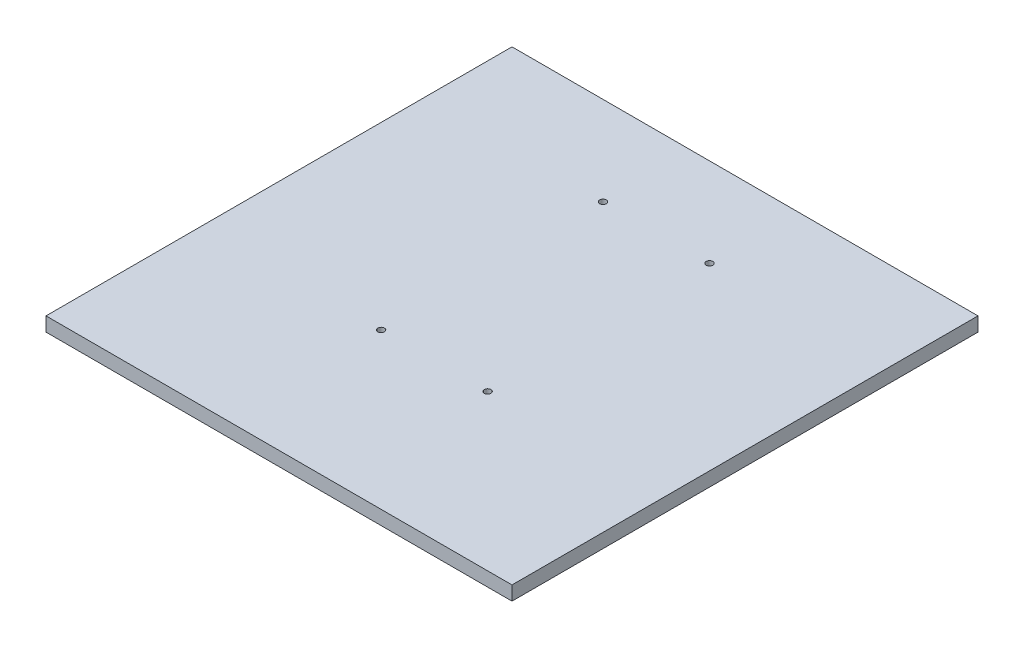
ISO-10303-21;
HEADER;
FILE_DESCRIPTION(('STEP AP214'),'2;1');
FILE_NAME('part.step','',(''),(''),'','','');
FILE_SCHEMA(('AUTOMOTIVE_DESIGN { 1 0 10303 214 1 1 1 1 }'));
ENDSEC;
DATA;
#1=APPLICATION_CONTEXT('core data for automotive mechanical design processes');
#2=APPLICATION_PROTOCOL_DEFINITION('international standard','automotive_design',2000,#1);
#3=PRODUCT_CONTEXT('',#1,'mechanical');
#4=PRODUCT('Part','Part','',(#3));
#5=PRODUCT_RELATED_PRODUCT_CATEGORY('part','',(#4));
#6=PRODUCT_DEFINITION_FORMATION('','',#4);
#7=PRODUCT_DEFINITION_CONTEXT('part definition',#1,'design');
#8=PRODUCT_DEFINITION('design','',#6,#7);
#9=PRODUCT_DEFINITION_SHAPE('','',#8);
#10=(LENGTH_UNIT() NAMED_UNIT(*) SI_UNIT(.MILLI.,.METRE.));
#11=(NAMED_UNIT(*) PLANE_ANGLE_UNIT() SI_UNIT($,.RADIAN.));
#12=(NAMED_UNIT(*) SI_UNIT($,.STERADIAN.) SOLID_ANGLE_UNIT());
#13=UNCERTAINTY_MEASURE_WITH_UNIT(LENGTH_MEASURE(1.E-05),#10,'distance_accuracy_value','');
#14=(GEOMETRIC_REPRESENTATION_CONTEXT(3) GLOBAL_UNCERTAINTY_ASSIGNED_CONTEXT((#13)) GLOBAL_UNIT_ASSIGNED_CONTEXT((#10,
#11,#12)) REPRESENTATION_CONTEXT('',''));
#15=CARTESIAN_POINT('',(0.,0.,0.));
#16=DIRECTION('',(0.,0.,1.));
#17=DIRECTION('',(1.,0.,0.));
#18=AXIS2_PLACEMENT_3D('',#15,#16,#17);
#19=CARTESIAN_POINT('',(-105.,6.35,105.));
#20=DIRECTION('',(1.,0.,0.));
#21=DIRECTION('',(0.,0.,-1.));
#22=AXIS2_PLACEMENT_3D('',#19,#20,#21);
#23=PLANE('',#22);
#24=DIRECTION('',(0.,0.,1.));
#25=VECTOR('',#24,1.);
#26=CARTESIAN_POINT('',(-105.,0.,105.));
#27=LINE('',#26,#25);
#28=CARTESIAN_POINT('',(-105.,0.,-105.));
#29=VERTEX_POINT('',#28);
#30=CARTESIAN_POINT('',(-105.,0.,105.));
#31=VERTEX_POINT('',#30);
#32=EDGE_CURVE('E96',#29,#31,#27,.T.);
#33=ORIENTED_EDGE('',*,*,#32,.T.);
#34=DIRECTION('',(0.,-1.,0.));
#35=VECTOR('',#34,1.);
#36=CARTESIAN_POINT('',(-105.,6.35,105.));
#37=LINE('',#36,#35);
#38=CARTESIAN_POINT('',(-105.,6.35,105.));
#39=VERTEX_POINT('',#38);
#40=EDGE_CURVE('E11',#39,#31,#37,.T.);
#41=ORIENTED_EDGE('',*,*,#40,.F.);
#42=DIRECTION('',(0.,0.,1.));
#43=VECTOR('',#42,1.);
#44=CARTESIAN_POINT('',(-105.,6.35,105.));
#45=LINE('',#44,#43);
#46=CARTESIAN_POINT('',(-105.,6.35,-105.));
#47=VERTEX_POINT('',#46);
#48=EDGE_CURVE('E84',#47,#39,#45,.T.);
#49=ORIENTED_EDGE('',*,*,#48,.F.);
#50=DIRECTION('',(0.,-1.,0.));
#51=VECTOR('',#50,1.);
#52=CARTESIAN_POINT('',(-105.,6.35,-105.));
#53=LINE('',#52,#51);
#54=EDGE_CURVE('E92',#47,#29,#53,.T.);
#55=ORIENTED_EDGE('',*,*,#54,.T.);
#56=EDGE_LOOP('',(#33,#41,#49,#55));
#57=FACE_BOUND('',#56,.T.);
#58=ADVANCED_FACE('F33',(#57),#23,.F.);
#59=CARTESIAN_POINT('',(105.,6.35,105.));
#60=DIRECTION('',(0.,0.,-1.));
#61=DIRECTION('',(-1.,0.,0.));
#62=AXIS2_PLACEMENT_3D('',#59,#60,#61);
#63=PLANE('',#62);
#64=DIRECTION('',(1.,0.,0.));
#65=VECTOR('',#64,1.);
#66=CARTESIAN_POINT('',(105.,0.,105.));
#67=LINE('',#66,#65);
#68=CARTESIAN_POINT('',(105.,0.,105.));
#69=VERTEX_POINT('',#68);
#70=EDGE_CURVE('E88',#31,#69,#67,.T.);
#71=ORIENTED_EDGE('',*,*,#70,.T.);
#72=DIRECTION('',(0.,-1.,0.));
#73=VECTOR('',#72,1.);
#74=CARTESIAN_POINT('',(105.,6.35,105.));
#75=LINE('',#74,#73);
#76=CARTESIAN_POINT('',(105.,6.35,105.));
#77=VERTEX_POINT('',#76);
#78=EDGE_CURVE('E41',#77,#69,#75,.T.);
#79=ORIENTED_EDGE('',*,*,#78,.F.);
#80=DIRECTION('',(1.,0.,0.));
#81=VECTOR('',#80,1.);
#82=CARTESIAN_POINT('',(105.,6.35,105.));
#83=LINE('',#82,#81);
#84=EDGE_CURVE('E79',#39,#77,#83,.T.);
#85=ORIENTED_EDGE('',*,*,#84,.F.);
#86=ORIENTED_EDGE('',*,*,#40,.T.);
#87=EDGE_LOOP('',(#71,#79,#85,#86));
#88=FACE_BOUND('',#87,.T.);
#89=ADVANCED_FACE('F87',(#88),#63,.F.);
#90=CARTESIAN_POINT('',(105.,6.35,105.));
#91=DIRECTION('',(-1.,0.,0.));
#92=DIRECTION('',(0.,0.,1.));
#93=AXIS2_PLACEMENT_3D('',#90,#91,#92);
#94=PLANE('',#93);
#95=DIRECTION('',(0.,0.,-1.));
#96=VECTOR('',#95,1.);
#97=CARTESIAN_POINT('',(105.,0.,105.));
#98=LINE('',#97,#96);
#99=CARTESIAN_POINT('',(105.,0.,-105.));
#100=VERTEX_POINT('',#99);
#101=EDGE_CURVE('E66',#69,#100,#98,.T.);
#102=ORIENTED_EDGE('',*,*,#101,.T.);
#103=DIRECTION('',(0.,-1.,0.));
#104=VECTOR('',#103,1.);
#105=CARTESIAN_POINT('',(105.,6.35,-105.));
#106=LINE('',#105,#104);
#107=CARTESIAN_POINT('',(105.,6.35,-105.));
#108=VERTEX_POINT('',#107);
#109=EDGE_CURVE('E89',#108,#100,#106,.T.);
#110=ORIENTED_EDGE('',*,*,#109,.F.);
#111=DIRECTION('',(0.,0.,-1.));
#112=VECTOR('',#111,1.);
#113=CARTESIAN_POINT('',(105.,6.35,105.));
#114=LINE('',#113,#112);
#115=EDGE_CURVE('E82',#77,#108,#114,.T.);
#116=ORIENTED_EDGE('',*,*,#115,.F.);
#117=ORIENTED_EDGE('',*,*,#78,.T.);
#118=EDGE_LOOP('',(#102,#110,#116,#117));
#119=FACE_BOUND('',#118,.T.);
#120=ADVANCED_FACE('F90',(#119),#94,.F.);
#121=CARTESIAN_POINT('',(105.,6.35,-105.));
#122=DIRECTION('',(0.,0.,1.));
#123=DIRECTION('',(1.,0.,0.));
#124=AXIS2_PLACEMENT_3D('',#121,#122,#123);
#125=PLANE('',#124);
#126=DIRECTION('',(-1.,0.,0.));
#127=VECTOR('',#126,1.);
#128=CARTESIAN_POINT('',(105.,0.,-105.));
#129=LINE('',#128,#127);
#130=EDGE_CURVE('E72',#100,#29,#129,.T.);
#131=ORIENTED_EDGE('',*,*,#130,.T.);
#132=ORIENTED_EDGE('',*,*,#54,.F.);
#133=DIRECTION('',(-1.,0.,0.));
#134=VECTOR('',#133,1.);
#135=CARTESIAN_POINT('',(105.,6.35,-105.));
#136=LINE('',#135,#134);
#137=EDGE_CURVE('E49',#108,#47,#136,.T.);
#138=ORIENTED_EDGE('',*,*,#137,.F.);
#139=ORIENTED_EDGE('',*,*,#109,.T.);
#140=EDGE_LOOP('',(#131,#132,#138,#139));
#141=FACE_BOUND('',#140,.T.);
#142=ADVANCED_FACE('F104',(#141),#125,.F.);
#143=CARTESIAN_POINT('',(0.,6.35,0.));
#144=DIRECTION('',(0.,1.,0.));
#145=DIRECTION('',(0.,0.,1.));
#146=AXIS2_PLACEMENT_3D('',#143,#144,#145);
#147=PLANE('',#146);
#148=CARTESIAN_POINT('',(24.,6.35,-65.));
#149=DIRECTION('',(0.,1.,0.));
#150=DIRECTION('',(0.,0.,1.));
#151=AXIS2_PLACEMENT_3D('',#148,#149,#150);
#152=CIRCLE('',#151,1.5);
#153=CARTESIAN_POINT('',(24.,6.35,-63.5));
#154=VERTEX_POINT('',#153);
#155=EDGE_CURVE('E128',#154,#154,#152,.T.);
#156=ORIENTED_EDGE('',*,*,#155,.F.);
#157=EDGE_LOOP('',(#156));
#158=FACE_BOUND('',#157,.T.);
#159=CARTESIAN_POINT('',(-24.,6.35,-65.));
#160=DIRECTION('',(0.,1.,0.));
#161=DIRECTION('',(0.,0.,1.));
#162=AXIS2_PLACEMENT_3D('',#159,#160,#161);
#163=CIRCLE('',#162,1.5);
#164=CARTESIAN_POINT('',(-24.,6.35,-63.5));
#165=VERTEX_POINT('',#164);
#166=EDGE_CURVE('E122',#165,#165,#163,.T.);
#167=ORIENTED_EDGE('',*,*,#166,.F.);
#168=EDGE_LOOP('',(#167));
#169=FACE_BOUND('',#168,.T.);
#170=CARTESIAN_POINT('',(-24.,6.35,35.));
#171=DIRECTION('',(0.,1.,0.));
#172=DIRECTION('',(0.,0.,1.));
#173=AXIS2_PLACEMENT_3D('',#170,#171,#172);
#174=CIRCLE('',#173,1.5);
#175=CARTESIAN_POINT('',(-24.,6.35,36.5));
#176=VERTEX_POINT('',#175);
#177=EDGE_CURVE('E116',#176,#176,#174,.T.);
#178=ORIENTED_EDGE('',*,*,#177,.F.);
#179=EDGE_LOOP('',(#178));
#180=FACE_BOUND('',#179,.T.);
#181=CARTESIAN_POINT('',(24.,6.35,35.));
#182=DIRECTION('',(0.,1.,0.));
#183=DIRECTION('',(0.,0.,1.));
#184=AXIS2_PLACEMENT_3D('',#181,#182,#183);
#185=CIRCLE('',#184,1.5);
#186=CARTESIAN_POINT('',(24.,6.35,36.5));
#187=VERTEX_POINT('',#186);
#188=EDGE_CURVE('E110',#187,#187,#185,.T.);
#189=ORIENTED_EDGE('',*,*,#188,.F.);
#190=EDGE_LOOP('',(#189));
#191=FACE_BOUND('',#190,.T.);
#192=ORIENTED_EDGE('',*,*,#48,.T.);
#193=ORIENTED_EDGE('',*,*,#84,.T.);
#194=ORIENTED_EDGE('',*,*,#115,.T.);
#195=ORIENTED_EDGE('',*,*,#137,.T.);
#196=EDGE_LOOP('',(#192,#193,#194,#195));
#197=FACE_BOUND('',#196,.T.);
#198=ADVANCED_FACE('F80',(#158,#169,#180,#191,#197),#147,.T.);
#199=CARTESIAN_POINT('',(0.,0.,0.));
#200=DIRECTION('',(0.,1.,0.));
#201=DIRECTION('',(0.,0.,1.));
#202=AXIS2_PLACEMENT_3D('',#199,#200,#201);
#203=PLANE('',#202);
#204=CARTESIAN_POINT('',(24.,0.,-65.));
#205=DIRECTION('',(0.,1.,0.));
#206=DIRECTION('',(0.,0.,1.));
#207=AXIS2_PLACEMENT_3D('',#204,#205,#206);
#208=CIRCLE('',#207,1.5);
#209=CARTESIAN_POINT('',(24.,0.,-63.5));
#210=VERTEX_POINT('',#209);
#211=EDGE_CURVE('E125',#210,#210,#208,.T.);
#212=ORIENTED_EDGE('',*,*,#211,.T.);
#213=EDGE_LOOP('',(#212));
#214=FACE_BOUND('',#213,.T.);
#215=CARTESIAN_POINT('',(-24.,0.,-65.));
#216=DIRECTION('',(0.,1.,0.));
#217=DIRECTION('',(0.,0.,1.));
#218=AXIS2_PLACEMENT_3D('',#215,#216,#217);
#219=CIRCLE('',#218,1.5);
#220=CARTESIAN_POINT('',(-24.,0.,-63.5));
#221=VERTEX_POINT('',#220);
#222=EDGE_CURVE('E119',#221,#221,#219,.T.);
#223=ORIENTED_EDGE('',*,*,#222,.T.);
#224=EDGE_LOOP('',(#223));
#225=FACE_BOUND('',#224,.T.);
#226=CARTESIAN_POINT('',(-24.,0.,35.));
#227=DIRECTION('',(0.,1.,0.));
#228=DIRECTION('',(0.,0.,1.));
#229=AXIS2_PLACEMENT_3D('',#226,#227,#228);
#230=CIRCLE('',#229,1.5);
#231=CARTESIAN_POINT('',(-24.,0.,36.5));
#232=VERTEX_POINT('',#231);
#233=EDGE_CURVE('E113',#232,#232,#230,.T.);
#234=ORIENTED_EDGE('',*,*,#233,.T.);
#235=EDGE_LOOP('',(#234));
#236=FACE_BOUND('',#235,.T.);
#237=CARTESIAN_POINT('',(24.,0.,35.));
#238=DIRECTION('',(0.,1.,0.));
#239=DIRECTION('',(0.,0.,1.));
#240=AXIS2_PLACEMENT_3D('',#237,#238,#239);
#241=CIRCLE('',#240,1.5);
#242=CARTESIAN_POINT('',(24.,0.,36.5));
#243=VERTEX_POINT('',#242);
#244=EDGE_CURVE('E99',#243,#243,#241,.T.);
#245=ORIENTED_EDGE('',*,*,#244,.T.);
#246=EDGE_LOOP('',(#245));
#247=FACE_BOUND('',#246,.T.);
#248=ORIENTED_EDGE('',*,*,#32,.F.);
#249=ORIENTED_EDGE('',*,*,#130,.F.);
#250=ORIENTED_EDGE('',*,*,#101,.F.);
#251=ORIENTED_EDGE('',*,*,#70,.F.);
#252=EDGE_LOOP('',(#248,#249,#250,#251));
#253=FACE_BOUND('',#252,.T.);
#254=ADVANCED_FACE('F107',(#214,#225,#236,#247,#253),#203,.F.);
#255=CARTESIAN_POINT('',(24.,0.,35.));
#256=DIRECTION('',(0.,1.,0.));
#257=DIRECTION('',(0.,0.,1.));
#258=AXIS2_PLACEMENT_3D('',#255,#256,#257);
#259=CYLINDRICAL_SURFACE('',#258,1.5);
#260=ORIENTED_EDGE('',*,*,#244,.F.);
#261=EDGE_LOOP('',(#260));
#262=FACE_BOUND('',#261,.T.);
#263=ORIENTED_EDGE('',*,*,#188,.T.);
#264=EDGE_LOOP('',(#263));
#265=FACE_BOUND('',#264,.T.);
#266=ADVANCED_FACE('F152',(#262,#265),#259,.F.);
#267=CARTESIAN_POINT('',(-24.,0.,35.));
#268=DIRECTION('',(0.,1.,0.));
#269=DIRECTION('',(0.,0.,1.));
#270=AXIS2_PLACEMENT_3D('',#267,#268,#269);
#271=CYLINDRICAL_SURFACE('',#270,1.5);
#272=ORIENTED_EDGE('',*,*,#233,.F.);
#273=EDGE_LOOP('',(#272));
#274=FACE_BOUND('',#273,.T.);
#275=ORIENTED_EDGE('',*,*,#177,.T.);
#276=EDGE_LOOP('',(#275));
#277=FACE_BOUND('',#276,.T.);
#278=ADVANCED_FACE('F154',(#274,#277),#271,.F.);
#279=CARTESIAN_POINT('',(-24.,0.,-65.));
#280=DIRECTION('',(0.,1.,0.));
#281=DIRECTION('',(0.,0.,1.));
#282=AXIS2_PLACEMENT_3D('',#279,#280,#281);
#283=CYLINDRICAL_SURFACE('',#282,1.5);
#284=ORIENTED_EDGE('',*,*,#222,.F.);
#285=EDGE_LOOP('',(#284));
#286=FACE_BOUND('',#285,.T.);
#287=ORIENTED_EDGE('',*,*,#166,.T.);
#288=EDGE_LOOP('',(#287));
#289=FACE_BOUND('',#288,.T.);
#290=ADVANCED_FACE('F139',(#286,#289),#283,.F.);
#291=CARTESIAN_POINT('',(24.,0.,-65.));
#292=DIRECTION('',(0.,1.,0.));
#293=DIRECTION('',(0.,0.,1.));
#294=AXIS2_PLACEMENT_3D('',#291,#292,#293);
#295=CYLINDRICAL_SURFACE('',#294,1.5);
#296=ORIENTED_EDGE('',*,*,#211,.F.);
#297=EDGE_LOOP('',(#296));
#298=FACE_BOUND('',#297,.T.);
#299=ORIENTED_EDGE('',*,*,#155,.T.);
#300=EDGE_LOOP('',(#299));
#301=FACE_BOUND('',#300,.T.);
#302=ADVANCED_FACE('F136',(#298,#301),#295,.F.);
#303=CLOSED_SHELL('',(#58,#89,#120,#142,#198,#254,#266,#278,#290,#302));
#304=MANIFOLD_SOLID_BREP('B2',#303);
#305=ADVANCED_BREP_SHAPE_REPRESENTATION('',(#18,#304),#14);
#306=SHAPE_DEFINITION_REPRESENTATION(#9,#305);
ENDSEC;
END-ISO-10303-21;
